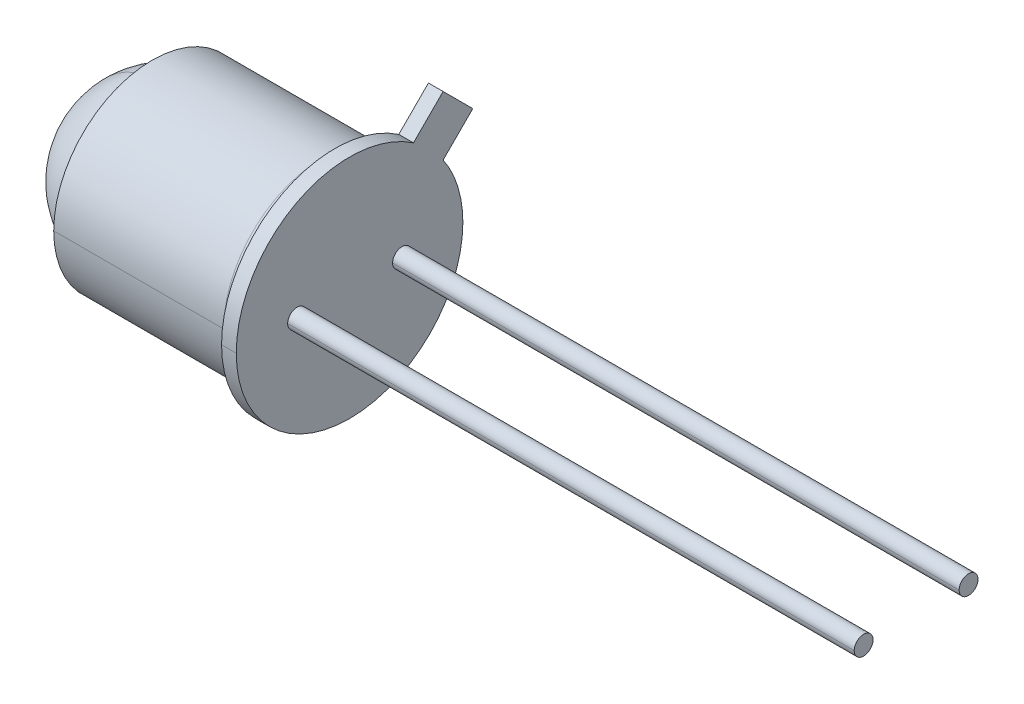
ISO-10303-21;
HEADER;
FILE_DESCRIPTION(('STEP AP214'),'2;1');
FILE_NAME('part.step','',(''),(''),'','','');
FILE_SCHEMA(('AUTOMOTIVE_DESIGN { 1 0 10303 214 1 1 1 1 }'));
ENDSEC;
DATA;
#1=APPLICATION_CONTEXT('core data for automotive mechanical design processes');
#2=APPLICATION_PROTOCOL_DEFINITION('international standard','automotive_design',2000,#1);
#3=PRODUCT_CONTEXT('',#1,'mechanical');
#4=PRODUCT('Part','Part','',(#3));
#5=PRODUCT_RELATED_PRODUCT_CATEGORY('part','',(#4));
#6=PRODUCT_DEFINITION_FORMATION('','',#4);
#7=PRODUCT_DEFINITION_CONTEXT('part definition',#1,'design');
#8=PRODUCT_DEFINITION('design','',#6,#7);
#9=PRODUCT_DEFINITION_SHAPE('','',#8);
#10=(LENGTH_UNIT() NAMED_UNIT(*) SI_UNIT(.MILLI.,.METRE.));
#11=(NAMED_UNIT(*) PLANE_ANGLE_UNIT() SI_UNIT($,.RADIAN.));
#12=(NAMED_UNIT(*) SI_UNIT($,.STERADIAN.) SOLID_ANGLE_UNIT());
#13=UNCERTAINTY_MEASURE_WITH_UNIT(LENGTH_MEASURE(1.E-05),#10,'distance_accuracy_value','');
#14=(GEOMETRIC_REPRESENTATION_CONTEXT(3) GLOBAL_UNCERTAINTY_ASSIGNED_CONTEXT((#13)) GLOBAL_UNIT_ASSIGNED_CONTEXT((#10,
#11,#12)) REPRESENTATION_CONTEXT('',''));
#15=CARTESIAN_POINT('',(0.,0.,0.));
#16=DIRECTION('',(0.,0.,1.));
#17=DIRECTION('',(1.,0.,0.));
#18=AXIS2_PLACEMENT_3D('',#15,#16,#17);
#19=CARTESIAN_POINT('',(-2.37352941176471,0.,0.));
#20=DIRECTION('',(0.,0.,-1.));
#21=DIRECTION('',(0.,-1.,0.));
#22=AXIS2_PLACEMENT_3D('',#19,#20,#21);
#23=SPHERICAL_SURFACE('',#22,2.02647058823529);
#24=CARTESIAN_POINT('',(-2.37352941176471,0.,0.));
#25=DIRECTION('',(0.,0.,-1.));
#26=DIRECTION('',(0.,1.,0.));
#27=AXIS2_PLACEMENT_3D('',#24,#25,#26);
#28=CIRCLE('',#27,2.02647058823529);
#29=CARTESIAN_POINT('',(-4.4,0.,0.));
#30=VERTEX_POINT('',#29);
#31=CARTESIAN_POINT('',(-0.347058823529413,0.,0.));
#32=VERTEX_POINT('',#31);
#33=EDGE_CURVE('P0_E11',#30,#32,#28,.T.);
#34=ORIENTED_EDGE('',*,*,#33,.F.);
#35=CARTESIAN_POINT('',(-2.37352941176471,0.,0.));
#36=DIRECTION('',(0.,0.,1.));
#37=DIRECTION('',(1.,0.,0.));
#38=AXIS2_PLACEMENT_3D('',#35,#36,#37);
#39=CIRCLE('',#38,2.02647058823529);
#40=EDGE_CURVE('P0_E24',#30,#32,#39,.T.);
#41=ORIENTED_EDGE('',*,*,#40,.T.);
#42=EDGE_LOOP('',(#34,#41));
#43=FACE_BOUND('',#42,.T.);
#44=ADVANCED_FACE('P0_F16',(#43),#23,.T.);
#45=CARTESIAN_POINT('',(-2.37352941176471,0.,0.));
#46=DIRECTION('',(0.,0.,-1.));
#47=DIRECTION('',(0.,-1.,0.));
#48=AXIS2_PLACEMENT_3D('',#45,#46,#47);
#49=SPHERICAL_SURFACE('',#48,2.02647058823529);
#50=ORIENTED_EDGE('',*,*,#40,.F.);
#51=ORIENTED_EDGE('',*,*,#33,.T.);
#52=EDGE_LOOP('',(#50,#51));
#53=FACE_BOUND('',#52,.T.);
#54=ADVANCED_FACE('P0_F40',(#53),#49,.T.);
#55=CLOSED_SHELL('',(#44,#54));
#56=MANIFOLD_SOLID_BREP('P0_B1',#55);
#57=CARTESIAN_POINT('',(-0.349999999999991,2.58327308511593,-2.58327308511592));
#58=DIRECTION('',(0.,0.707106781186549,-0.707106781186546));
#59=DIRECTION('',(-1.,0.,0.));
#60=AXIS2_PLACEMENT_3D('',#57,#58,#59);
#61=PLANE('',#60);
#62=DIRECTION('',(0.,-0.707106781186546,-0.707106781186549));
#63=VECTOR('',#62,1.);
#64=CARTESIAN_POINT('',(1.65,2.58327308511593,-2.58327308511592));
#65=LINE('',#64,#63);
#66=CARTESIAN_POINT('',(1.65,2.93682647570919,-2.22971969452264));
#67=VERTEX_POINT('',#66);
#68=CARTESIAN_POINT('',(1.65,2.22971969452265,-2.93682647570918));
#69=VERTEX_POINT('',#68);
#70=EDGE_CURVE('P1_E162',#67,#69,#65,.T.);
#71=ORIENTED_EDGE('',*,*,#70,.F.);
#72=DIRECTION('',(1.,0.,0.));
#73=VECTOR('',#72,1.);
#74=CARTESIAN_POINT('',(-0.349999999999991,2.93682647570919,-2.22971969452264));
#75=LINE('',#74,#73);
#76=CARTESIAN_POINT('',(2.,2.93682647570919,-2.22971969452264));
#77=VERTEX_POINT('',#76);
#78=EDGE_CURVE('P1_E11',#67,#77,#75,.T.);
#79=ORIENTED_EDGE('',*,*,#78,.T.);
#80=DIRECTION('',(0.,0.707106781186546,0.707106781186549));
#81=VECTOR('',#80,1.);
#82=CARTESIAN_POINT('',(2.,2.58327308511593,-2.58327308511592));
#83=LINE('',#82,#81);
#84=CARTESIAN_POINT('',(2.,2.22971969452265,-2.93682647570918));
#85=VERTEX_POINT('',#84);
#86=EDGE_CURVE('P1_E159',#85,#77,#83,.T.);
#87=ORIENTED_EDGE('',*,*,#86,.F.);
#88=DIRECTION('',(1.,0.,0.));
#89=VECTOR('',#88,1.);
#90=CARTESIAN_POINT('',(-0.349999999999991,2.22971969452265,-2.93682647570918));
#91=LINE('',#90,#89);
#92=EDGE_CURVE('P1_E27',#69,#85,#91,.T.);
#93=ORIENTED_EDGE('',*,*,#92,.F.);
#94=EDGE_LOOP('',(#71,#79,#87,#93));
#95=FACE_BOUND('',#94,.T.);
#96=ADVANCED_FACE('P1_F16',(#95),#61,.T.);
#97=CARTESIAN_POINT('',(-0.349999999999991,0.35355339059327,0.353553390593271));
#98=DIRECTION('',(0.,0.707106781186546,0.707106781186549));
#99=DIRECTION('',(1.,0.,0.));
#100=AXIS2_PLACEMENT_3D('',#97,#98,#99);
#101=PLANE('',#100);
#102=DIRECTION('',(0.,0.707106781186549,-0.707106781186546));
#103=VECTOR('',#102,1.);
#104=CARTESIAN_POINT('',(1.65,0.35355339059327,0.353553390593271));
#105=LINE('',#104,#103);
#106=CARTESIAN_POINT('',(1.65,2.22971969452264,-1.5226129133361));
#107=VERTEX_POINT('',#106);
#108=EDGE_CURVE('P1_E218',#107,#67,#105,.T.);
#109=ORIENTED_EDGE('',*,*,#108,.F.);
#110=DIRECTION('',(1.,0.,0.));
#111=VECTOR('',#110,1.);
#112=CARTESIAN_POINT('',(-0.349999999999991,2.22971969452264,-1.5226129133361));
#113=LINE('',#112,#111);
#114=CARTESIAN_POINT('',(2.,2.22971969452264,-1.5226129133361));
#115=VERTEX_POINT('',#114);
#116=EDGE_CURVE('P1_E170',#107,#115,#113,.T.);
#117=ORIENTED_EDGE('',*,*,#116,.T.);
#118=DIRECTION('',(0.,-0.707106781186549,0.707106781186546));
#119=VECTOR('',#118,1.);
#120=CARTESIAN_POINT('',(2.,0.35355339059327,0.353553390593271));
#121=LINE('',#120,#119);
#122=EDGE_CURVE('P1_E167',#77,#115,#121,.T.);
#123=ORIENTED_EDGE('',*,*,#122,.F.);
#124=ORIENTED_EDGE('',*,*,#78,.F.);
#125=EDGE_LOOP('',(#109,#117,#123,#124));
#126=FACE_BOUND('',#125,.T.);
#127=ADVANCED_FACE('P1_F168',(#126),#101,.T.);
#128=CARTESIAN_POINT('',(-0.349999999999991,-0.35355339059327,-0.353553390593272));
#129=DIRECTION('',(0.,0.707106781186546,0.707106781186549));
#130=DIRECTION('',(1.,0.,0.));
#131=AXIS2_PLACEMENT_3D('',#128,#129,#130);
#132=PLANE('',#131);
#133=DIRECTION('',(1.,0.,0.));
#134=VECTOR('',#133,1.);
#135=CARTESIAN_POINT('',(-0.349999999999991,1.52261291333611,-2.22971969452264));
#136=LINE('',#135,#134);
#137=CARTESIAN_POINT('',(1.65,1.52261291333611,-2.22971969452264));
#138=VERTEX_POINT('',#137);
#139=CARTESIAN_POINT('',(2.,1.52261291333611,-2.22971969452264));
#140=VERTEX_POINT('',#139);
#141=EDGE_CURVE('P1_E196',#138,#140,#136,.T.);
#142=ORIENTED_EDGE('',*,*,#141,.F.);
#143=DIRECTION('',(0.,0.707106781186549,-0.707106781186546));
#144=VECTOR('',#143,1.);
#145=CARTESIAN_POINT('',(1.65,-0.35355339059327,-0.353553390593272));
#146=LINE('',#145,#144);
#147=EDGE_CURVE('P1_E211',#138,#69,#146,.T.);
#148=ORIENTED_EDGE('',*,*,#147,.T.);
#149=ORIENTED_EDGE('',*,*,#92,.T.);
#150=DIRECTION('',(0.,-0.707106781186549,0.707106781186546));
#151=VECTOR('',#150,1.);
#152=CARTESIAN_POINT('',(2.,-0.35355339059327,-0.353553390593272));
#153=LINE('',#152,#151);
#154=EDGE_CURVE('P1_E179',#85,#140,#153,.T.);
#155=ORIENTED_EDGE('',*,*,#154,.T.);
#156=EDGE_LOOP('',(#142,#148,#149,#155));
#157=FACE_BOUND('',#156,.T.);
#158=ADVANCED_FACE('P1_F424',(#157),#132,.F.);
#159=CARTESIAN_POINT('',(15.5,0.,0.));
#160=DIRECTION('',(1.,0.,0.));
#161=DIRECTION('',(0.,1.,0.));
#162=AXIS2_PLACEMENT_3D('',#159,#160,#161);
#163=PLANE('',#162);
#164=CARTESIAN_POINT('',(15.5,0.,-1.25));
#165=DIRECTION('',(1.,0.,0.));
#166=DIRECTION('',(0.,0.,-1.));
#167=AXIS2_PLACEMENT_3D('',#164,#165,#166);
#168=CIRCLE('',#167,0.225);
#169=CARTESIAN_POINT('',(15.5,0.,-1.025));
#170=VERTEX_POINT('',#169);
#171=CARTESIAN_POINT('',(15.5,0.,-1.475));
#172=VERTEX_POINT('',#171);
#173=EDGE_CURVE('P1_E214',#170,#172,#168,.T.);
#174=ORIENTED_EDGE('',*,*,#173,.T.);
#175=CARTESIAN_POINT('',(15.5,0.,-1.25));
#176=DIRECTION('',(1.,0.,0.));
#177=DIRECTION('',(0.,0.,-1.));
#178=AXIS2_PLACEMENT_3D('',#175,#176,#177);
#179=CIRCLE('',#178,0.225);
#180=EDGE_CURVE('P1_E278',#172,#170,#179,.T.);
#181=ORIENTED_EDGE('',*,*,#180,.T.);
#182=EDGE_LOOP('',(#174,#181));
#183=FACE_BOUND('',#182,.T.);
#184=ADVANCED_FACE('P1_F417',(#183),#163,.T.);
#185=CARTESIAN_POINT('',(15.5,0.,-1.25));
#186=DIRECTION('',(-1.,0.,0.));
#187=DIRECTION('',(0.,0.,1.));
#188=AXIS2_PLACEMENT_3D('',#185,#186,#187);
#189=CYLINDRICAL_SURFACE('',#188,0.225);
#190=DIRECTION('',(-1.,0.,0.));
#191=VECTOR('',#190,1.);
#192=CARTESIAN_POINT('',(15.5,0.,-1.475));
#193=LINE('',#192,#191);
#194=CARTESIAN_POINT('',(2.,0.,-1.475));
#195=VERTEX_POINT('',#194);
#196=EDGE_CURVE('P1_E236',#172,#195,#193,.T.);
#197=ORIENTED_EDGE('',*,*,#196,.F.);
#198=ORIENTED_EDGE('',*,*,#173,.F.);
#199=DIRECTION('',(-1.,0.,0.));
#200=VECTOR('',#199,1.);
#201=CARTESIAN_POINT('',(15.5,0.,-1.025));
#202=LINE('',#201,#200);
#203=CARTESIAN_POINT('',(2.,0.,-1.025));
#204=VERTEX_POINT('',#203);
#205=EDGE_CURVE('P1_E235',#170,#204,#202,.T.);
#206=ORIENTED_EDGE('',*,*,#205,.T.);
#207=CARTESIAN_POINT('',(2.,0.,-1.25));
#208=DIRECTION('',(1.,0.,0.));
#209=DIRECTION('',(0.,0.,1.));
#210=AXIS2_PLACEMENT_3D('',#207,#208,#209);
#211=CIRCLE('',#210,0.225);
#212=EDGE_CURVE('P1_E117',#204,#195,#211,.T.);
#213=ORIENTED_EDGE('',*,*,#212,.T.);
#214=EDGE_LOOP('',(#197,#198,#206,#213));
#215=FACE_BOUND('',#214,.T.);
#216=ADVANCED_FACE('P1_F423',(#215),#189,.T.);
#217=CARTESIAN_POINT('',(15.5,0.,0.));
#218=DIRECTION('',(1.,0.,0.));
#219=DIRECTION('',(0.,1.,0.));
#220=AXIS2_PLACEMENT_3D('',#217,#218,#219);
#221=PLANE('',#220);
#222=CARTESIAN_POINT('',(15.5,0.,1.25));
#223=DIRECTION('',(1.,0.,0.));
#224=DIRECTION('',(0.,0.,-1.));
#225=AXIS2_PLACEMENT_3D('',#222,#223,#224);
#226=CIRCLE('',#225,0.225);
#227=CARTESIAN_POINT('',(15.5,0.,1.475));
#228=VERTEX_POINT('',#227);
#229=CARTESIAN_POINT('',(15.5,0.,1.025));
#230=VERTEX_POINT('',#229);
#231=EDGE_CURVE('P1_E106',#228,#230,#226,.T.);
#232=ORIENTED_EDGE('',*,*,#231,.T.);
#233=CARTESIAN_POINT('',(15.5,0.,1.25));
#234=DIRECTION('',(1.,0.,0.));
#235=DIRECTION('',(0.,0.,-1.));
#236=AXIS2_PLACEMENT_3D('',#233,#234,#235);
#237=CIRCLE('',#236,0.225);
#238=EDGE_CURVE('P1_E296',#230,#228,#237,.T.);
#239=ORIENTED_EDGE('',*,*,#238,.T.);
#240=EDGE_LOOP('',(#232,#239));
#241=FACE_BOUND('',#240,.T.);
#242=ADVANCED_FACE('P1_F437',(#241),#221,.T.);
#243=CARTESIAN_POINT('',(15.5,0.,1.25));
#244=DIRECTION('',(-1.,0.,0.));
#245=DIRECTION('',(0.,0.,1.));
#246=AXIS2_PLACEMENT_3D('',#243,#244,#245);
#247=CYLINDRICAL_SURFACE('',#246,0.225);
#248=DIRECTION('',(-1.,0.,0.));
#249=VECTOR('',#248,1.);
#250=CARTESIAN_POINT('',(15.5,0.,1.025));
#251=LINE('',#250,#249);
#252=CARTESIAN_POINT('',(2.,0.,1.025));
#253=VERTEX_POINT('',#252);
#254=EDGE_CURVE('P1_E299',#230,#253,#251,.T.);
#255=ORIENTED_EDGE('',*,*,#254,.F.);
#256=ORIENTED_EDGE('',*,*,#231,.F.);
#257=DIRECTION('',(-1.,0.,0.));
#258=VECTOR('',#257,1.);
#259=CARTESIAN_POINT('',(15.5,0.,1.475));
#260=LINE('',#259,#258);
#261=CARTESIAN_POINT('',(2.,0.,1.475));
#262=VERTEX_POINT('',#261);
#263=EDGE_CURVE('P1_E312',#228,#262,#260,.T.);
#264=ORIENTED_EDGE('',*,*,#263,.T.);
#265=CARTESIAN_POINT('',(2.,0.,1.25));
#266=DIRECTION('',(1.,0.,0.));
#267=DIRECTION('',(0.,0.,1.));
#268=AXIS2_PLACEMENT_3D('',#265,#266,#267);
#269=CIRCLE('',#268,0.225);
#270=EDGE_CURVE('P1_E174',#262,#253,#269,.T.);
#271=ORIENTED_EDGE('',*,*,#270,.T.);
#272=EDGE_LOOP('',(#255,#256,#264,#271));
#273=FACE_BOUND('',#272,.T.);
#274=ADVANCED_FACE('P1_F442',(#273),#247,.T.);
#275=CARTESIAN_POINT('',(-2.49171245983604,0.,0.));
#276=DIRECTION('',(-1.,0.,0.));
#277=DIRECTION('',(0.,0.,1.));
#278=AXIS2_PLACEMENT_3D('',#275,#276,#277);
#279=CYLINDRICAL_SURFACE('',#278,2.35);
#280=DIRECTION('',(-1.,0.,0.));
#281=VECTOR('',#280,1.);
#282=CARTESIAN_POINT('',(-2.49171245983604,0.,-2.35));
#283=LINE('',#282,#281);
#284=CARTESIAN_POINT('',(1.35,0.,-2.35));
#285=VERTEX_POINT('',#284);
#286=CARTESIAN_POINT('',(-2.7,0.,-2.35));
#287=VERTEX_POINT('',#286);
#288=EDGE_CURVE('P1_E332',#285,#287,#283,.T.);
#289=ORIENTED_EDGE('',*,*,#288,.F.);
#290=CARTESIAN_POINT('',(1.35,0.,0.));
#291=DIRECTION('',(-1.,0.,0.));
#292=DIRECTION('',(0.,0.,1.));
#293=AXIS2_PLACEMENT_3D('',#290,#291,#292);
#294=CIRCLE('',#293,2.35);
#295=CARTESIAN_POINT('',(1.35,0.,2.35));
#296=VERTEX_POINT('',#295);
#297=EDGE_CURVE('P1_E205',#285,#296,#294,.T.);
#298=ORIENTED_EDGE('',*,*,#297,.T.);
#299=DIRECTION('',(-1.,0.,0.));
#300=VECTOR('',#299,1.);
#301=CARTESIAN_POINT('',(-2.49171245983604,0.,2.35));
#302=LINE('',#301,#300);
#303=CARTESIAN_POINT('',(-2.7,0.,2.35));
#304=VERTEX_POINT('',#303);
#305=EDGE_CURVE('P1_E201',#296,#304,#302,.T.);
#306=ORIENTED_EDGE('',*,*,#305,.T.);
#307=CARTESIAN_POINT('',(-2.7,0.,0.));
#308=DIRECTION('',(-1.,0.,0.));
#309=DIRECTION('',(0.,0.,1.));
#310=AXIS2_PLACEMENT_3D('',#307,#308,#309);
#311=CIRCLE('',#310,2.35);
#312=EDGE_CURVE('P1_E283',#287,#304,#311,.T.);
#313=ORIENTED_EDGE('',*,*,#312,.F.);
#314=EDGE_LOOP('',(#289,#298,#306,#313));
#315=FACE_BOUND('',#314,.T.);
#316=ADVANCED_FACE('P1_F367',(#315),#279,.T.);
#317=CARTESIAN_POINT('',(1.35,0.,0.));
#318=DIRECTION('',(-1.,0.,0.));
#319=DIRECTION('',(0.,0.,1.));
#320=AXIS2_PLACEMENT_3D('',#317,#318,#319);
#321=TOROIDAL_SURFACE('',#320,2.65,0.3);
#322=CARTESIAN_POINT('',(1.35,0.,-2.65));
#323=DIRECTION('',(0.,1.,0.));
#324=DIRECTION('',(0.,0.,1.));
#325=AXIS2_PLACEMENT_3D('',#322,#323,#324);
#326=CIRCLE('',#325,0.3);
#327=CARTESIAN_POINT('',(1.65,0.,-2.65));
#328=VERTEX_POINT('',#327);
#329=EDGE_CURVE('P1_E265',#285,#328,#326,.T.);
#330=ORIENTED_EDGE('',*,*,#329,.F.);
#331=CARTESIAN_POINT('',(1.35,0.,0.));
#332=DIRECTION('',(-1.,0.,0.));
#333=DIRECTION('',(0.,0.,1.));
#334=AXIS2_PLACEMENT_3D('',#331,#332,#333);
#335=CIRCLE('',#334,2.35);
#336=EDGE_CURVE('P1_E320',#296,#285,#335,.T.);
#337=ORIENTED_EDGE('',*,*,#336,.F.);
#338=CARTESIAN_POINT('',(1.35,0.,2.65));
#339=DIRECTION('',(0.,-1.,0.));
#340=DIRECTION('',(0.,0.,-1.));
#341=AXIS2_PLACEMENT_3D('',#338,#339,#340);
#342=CIRCLE('',#341,0.3);
#343=CARTESIAN_POINT('',(1.65,0.,2.65));
#344=VERTEX_POINT('',#343);
#345=EDGE_CURVE('P1_E264',#296,#344,#342,.T.);
#346=ORIENTED_EDGE('',*,*,#345,.T.);
#347=CARTESIAN_POINT('',(1.65,0.,0.));
#348=DIRECTION('',(-1.,0.,0.));
#349=DIRECTION('',(0.,0.,1.));
#350=AXIS2_PLACEMENT_3D('',#347,#348,#349);
#351=CIRCLE('',#350,2.65);
#352=EDGE_CURVE('P1_E207',#344,#328,#351,.T.);
#353=ORIENTED_EDGE('',*,*,#352,.T.);
#354=EDGE_LOOP('',(#330,#337,#346,#353));
#355=FACE_BOUND('',#354,.T.);
#356=ADVANCED_FACE('P1_F18',(#355),#321,.F.);
#357=CARTESIAN_POINT('',(1.65,2.7,0.));
#358=DIRECTION('',(1.,0.,0.));
#359=DIRECTION('',(0.,1.,0.));
#360=AXIS2_PLACEMENT_3D('',#357,#358,#359);
#361=PLANE('',#360);
#362=ORIENTED_EDGE('',*,*,#352,.F.);
#363=CARTESIAN_POINT('',(1.65,0.,0.));
#364=DIRECTION('',(-1.,0.,0.));
#365=DIRECTION('',(0.,0.,1.));
#366=AXIS2_PLACEMENT_3D('',#363,#364,#365);
#367=CIRCLE('',#366,2.65);
#368=EDGE_CURVE('P1_E260',#328,#344,#367,.T.);
#369=ORIENTED_EDGE('',*,*,#368,.F.);
#370=EDGE_LOOP('',(#362,#369));
#371=FACE_BOUND('',#370,.T.);
#372=CARTESIAN_POINT('',(1.65,0.,0.));
#373=DIRECTION('',(-1.,0.,0.));
#374=DIRECTION('',(0.,0.,1.));
#375=AXIS2_PLACEMENT_3D('',#372,#373,#374);
#376=CIRCLE('',#375,2.7);
#377=CARTESIAN_POINT('',(1.65,0.,-2.7));
#378=VERTEX_POINT('',#377);
#379=EDGE_CURVE('P1_E192',#138,#378,#376,.T.);
#380=ORIENTED_EDGE('',*,*,#379,.T.);
#381=CARTESIAN_POINT('',(1.65,0.,0.));
#382=DIRECTION('',(-1.,0.,0.));
#383=DIRECTION('',(0.,0.,1.));
#384=AXIS2_PLACEMENT_3D('',#381,#382,#383);
#385=CIRCLE('',#384,2.7);
#386=CARTESIAN_POINT('',(1.65,0.,2.7));
#387=VERTEX_POINT('',#386);
#388=EDGE_CURVE('P1_E20',#378,#387,#385,.T.);
#389=ORIENTED_EDGE('',*,*,#388,.T.);
#390=CARTESIAN_POINT('',(1.65,0.,0.));
#391=DIRECTION('',(-1.,0.,0.));
#392=DIRECTION('',(0.,0.,1.));
#393=AXIS2_PLACEMENT_3D('',#390,#391,#392);
#394=CIRCLE('',#393,2.7);
#395=EDGE_CURVE('P1_E186',#387,#107,#394,.T.);
#396=ORIENTED_EDGE('',*,*,#395,.T.);
#397=ORIENTED_EDGE('',*,*,#108,.T.);
#398=ORIENTED_EDGE('',*,*,#70,.T.);
#399=ORIENTED_EDGE('',*,*,#147,.F.);
#400=EDGE_LOOP('',(#380,#389,#396,#397,#398,#399));
#401=FACE_BOUND('',#400,.T.);
#402=ADVANCED_FACE('P1_F376',(#371,#401),#361,.F.);
#403=CARTESIAN_POINT('',(0.,0.,0.));
#404=DIRECTION('',(1.,0.,0.));
#405=DIRECTION('',(0.,1.,0.));
#406=AXIS2_PLACEMENT_3D('',#403,#404,#405);
#407=PLANE('',#406);
#408=CARTESIAN_POINT('',(0.,0.,0.));
#409=DIRECTION('',(-1.,0.,0.));
#410=DIRECTION('',(0.,0.,1.));
#411=AXIS2_PLACEMENT_3D('',#408,#409,#410);
#412=CIRCLE('',#411,1.9);
#413=CARTESIAN_POINT('',(0.,0.,1.9));
#414=VERTEX_POINT('',#413);
#415=CARTESIAN_POINT('',(0.,0.,-1.9));
#416=VERTEX_POINT('',#415);
#417=EDGE_CURVE('P1_E221',#414,#416,#412,.T.);
#418=ORIENTED_EDGE('',*,*,#417,.T.);
#419=CARTESIAN_POINT('',(0.,0.,0.));
#420=DIRECTION('',(-1.,0.,0.));
#421=DIRECTION('',(0.,0.,1.));
#422=AXIS2_PLACEMENT_3D('',#419,#420,#421);
#423=CIRCLE('',#422,1.9);
#424=EDGE_CURVE('P1_E266',#416,#414,#423,.T.);
#425=ORIENTED_EDGE('',*,*,#424,.T.);
#426=EDGE_LOOP('',(#418,#425));
#427=FACE_BOUND('',#426,.T.);
#428=ADVANCED_FACE('P1_F477',(#427),#407,.F.);
#429=CARTESIAN_POINT('',(-2.49171245983604,0.,0.));
#430=DIRECTION('',(-1.,0.,0.));
#431=DIRECTION('',(0.,0.,1.));
#432=AXIS2_PLACEMENT_3D('',#429,#430,#431);
#433=CYLINDRICAL_SURFACE('',#432,1.9);
#434=DIRECTION('',(-1.,0.,0.));
#435=VECTOR('',#434,1.);
#436=CARTESIAN_POINT('',(-2.49171245983604,0.,-1.9));
#437=LINE('',#436,#435);
#438=CARTESIAN_POINT('',(-2.4,0.,-1.9));
#439=VERTEX_POINT('',#438);
#440=EDGE_CURVE('P1_E270',#416,#439,#437,.T.);
#441=ORIENTED_EDGE('',*,*,#440,.F.);
#442=ORIENTED_EDGE('',*,*,#417,.F.);
#443=DIRECTION('',(-1.,0.,0.));
#444=VECTOR('',#443,1.);
#445=CARTESIAN_POINT('',(-2.49171245983604,0.,1.9));
#446=LINE('',#445,#444);
#447=CARTESIAN_POINT('',(-2.4,0.,1.9));
#448=VERTEX_POINT('',#447);
#449=EDGE_CURVE('P1_E242',#414,#448,#446,.T.);
#450=ORIENTED_EDGE('',*,*,#449,.T.);
#451=CARTESIAN_POINT('',(-2.4,0.,0.));
#452=DIRECTION('',(-1.,0.,0.));
#453=DIRECTION('',(0.,0.,1.));
#454=AXIS2_PLACEMENT_3D('',#451,#452,#453);
#455=CIRCLE('',#454,1.9);
#456=EDGE_CURVE('P1_E222',#448,#439,#455,.T.);
#457=ORIENTED_EDGE('',*,*,#456,.T.);
#458=EDGE_LOOP('',(#441,#442,#450,#457));
#459=FACE_BOUND('',#458,.T.);
#460=ADVANCED_FACE('P1_F485',(#459),#433,.F.);
#461=CARTESIAN_POINT('',(-2.4,2.,0.));
#462=DIRECTION('',(1.,0.,0.));
#463=DIRECTION('',(0.,1.,0.));
#464=AXIS2_PLACEMENT_3D('',#461,#462,#463);
#465=PLANE('',#464);
#466=ORIENTED_EDGE('',*,*,#456,.F.);
#467=CARTESIAN_POINT('',(-2.4,0.,0.));
#468=DIRECTION('',(-1.,0.,0.));
#469=DIRECTION('',(0.,0.,1.));
#470=AXIS2_PLACEMENT_3D('',#467,#468,#469);
#471=CIRCLE('',#470,1.9);
#472=EDGE_CURVE('P1_E252',#439,#448,#471,.T.);
#473=ORIENTED_EDGE('',*,*,#472,.F.);
#474=EDGE_LOOP('',(#466,#473));
#475=FACE_BOUND('',#474,.T.);
#476=CARTESIAN_POINT('',(-2.4,0.,0.));
#477=DIRECTION('',(-1.,0.,0.));
#478=DIRECTION('',(0.,0.,1.));
#479=AXIS2_PLACEMENT_3D('',#476,#477,#478);
#480=CIRCLE('',#479,2.);
#481=CARTESIAN_POINT('',(-2.4,0.,2.));
#482=VERTEX_POINT('',#481);
#483=CARTESIAN_POINT('',(-2.4,0.,-2.));
#484=VERTEX_POINT('',#483);
#485=EDGE_CURVE('P1_E225',#482,#484,#480,.T.);
#486=ORIENTED_EDGE('',*,*,#485,.T.);
#487=CARTESIAN_POINT('',(-2.4,0.,0.));
#488=DIRECTION('',(-1.,0.,0.));
#489=DIRECTION('',(0.,0.,1.));
#490=AXIS2_PLACEMENT_3D('',#487,#488,#489);
#491=CIRCLE('',#490,2.);
#492=EDGE_CURVE('P1_E237',#484,#482,#491,.T.);
#493=ORIENTED_EDGE('',*,*,#492,.T.);
#494=EDGE_LOOP('',(#486,#493));
#495=FACE_BOUND('',#494,.T.);
#496=ADVANCED_FACE('P1_F494',(#475,#495),#465,.F.);
#497=CARTESIAN_POINT('',(-2.49171245983604,0.,0.));
#498=DIRECTION('',(-1.,0.,0.));
#499=DIRECTION('',(0.,0.,1.));
#500=AXIS2_PLACEMENT_3D('',#497,#498,#499);
#501=CYLINDRICAL_SURFACE('',#500,2.);
#502=DIRECTION('',(-1.,0.,0.));
#503=VECTOR('',#502,1.);
#504=CARTESIAN_POINT('',(-2.49171245983604,0.,-2.));
#505=LINE('',#504,#503);
#506=CARTESIAN_POINT('',(-2.7,0.,-2.));
#507=VERTEX_POINT('',#506);
#508=EDGE_CURVE('P1_E241',#484,#507,#505,.T.);
#509=ORIENTED_EDGE('',*,*,#508,.F.);
#510=ORIENTED_EDGE('',*,*,#485,.F.);
#511=DIRECTION('',(-1.,0.,0.));
#512=VECTOR('',#511,1.);
#513=CARTESIAN_POINT('',(-2.49171245983604,0.,2.));
#514=LINE('',#513,#512);
#515=CARTESIAN_POINT('',(-2.7,0.,2.));
#516=VERTEX_POINT('',#515);
#517=EDGE_CURVE('P1_E230',#482,#516,#514,.T.);
#518=ORIENTED_EDGE('',*,*,#517,.T.);
#519=CARTESIAN_POINT('',(-2.7,0.,0.));
#520=DIRECTION('',(-1.,0.,0.));
#521=DIRECTION('',(0.,0.,1.));
#522=AXIS2_PLACEMENT_3D('',#519,#520,#521);
#523=CIRCLE('',#522,2.);
#524=EDGE_CURVE('P1_E302',#516,#507,#523,.T.);
#525=ORIENTED_EDGE('',*,*,#524,.T.);
#526=EDGE_LOOP('',(#509,#510,#518,#525));
#527=FACE_BOUND('',#526,.T.);
#528=ADVANCED_FACE('P1_F503',(#527),#501,.F.);
#529=CARTESIAN_POINT('',(-2.7,2.,0.));
#530=DIRECTION('',(1.,0.,0.));
#531=DIRECTION('',(0.,1.,0.));
#532=AXIS2_PLACEMENT_3D('',#529,#530,#531);
#533=PLANE('',#532);
#534=ORIENTED_EDGE('',*,*,#524,.F.);
#535=CARTESIAN_POINT('',(-2.7,0.,0.));
#536=DIRECTION('',(-1.,0.,0.));
#537=DIRECTION('',(0.,0.,1.));
#538=AXIS2_PLACEMENT_3D('',#535,#536,#537);
#539=CIRCLE('',#538,2.);
#540=EDGE_CURVE('P1_E271',#507,#516,#539,.T.);
#541=ORIENTED_EDGE('',*,*,#540,.F.);
#542=EDGE_LOOP('',(#534,#541));
#543=FACE_BOUND('',#542,.T.);
#544=CARTESIAN_POINT('',(-2.7,0.,0.));
#545=DIRECTION('',(-1.,0.,0.));
#546=DIRECTION('',(0.,0.,1.));
#547=AXIS2_PLACEMENT_3D('',#544,#545,#546);
#548=CIRCLE('',#547,2.35);
#549=EDGE_CURVE('P1_E206',#304,#287,#548,.T.);
#550=ORIENTED_EDGE('',*,*,#549,.T.);
#551=ORIENTED_EDGE('',*,*,#312,.T.);
#552=EDGE_LOOP('',(#550,#551));
#553=FACE_BOUND('',#552,.T.);
#554=ADVANCED_FACE('P1_F357',(#543,#553),#533,.F.);
#555=CARTESIAN_POINT('',(2.,0.,0.));
#556=DIRECTION('',(-1.,0.,0.));
#557=DIRECTION('',(0.,0.,1.));
#558=AXIS2_PLACEMENT_3D('',#555,#556,#557);
#559=PLANE('',#558);
#560=ORIENTED_EDGE('',*,*,#212,.F.);
#561=CARTESIAN_POINT('',(2.,0.,-1.25));
#562=DIRECTION('',(1.,0.,0.));
#563=DIRECTION('',(0.,0.,1.));
#564=AXIS2_PLACEMENT_3D('',#561,#562,#563);
#565=CIRCLE('',#564,0.225);
#566=EDGE_CURVE('P1_E231',#195,#204,#565,.T.);
#567=ORIENTED_EDGE('',*,*,#566,.F.);
#568=EDGE_LOOP('',(#560,#567));
#569=FACE_BOUND('',#568,.T.);
#570=ORIENTED_EDGE('',*,*,#270,.F.);
#571=CARTESIAN_POINT('',(2.,0.,1.25));
#572=DIRECTION('',(1.,0.,0.));
#573=DIRECTION('',(0.,0.,1.));
#574=AXIS2_PLACEMENT_3D('',#571,#572,#573);
#575=CIRCLE('',#574,0.225);
#576=EDGE_CURVE('P1_E305',#253,#262,#575,.T.);
#577=ORIENTED_EDGE('',*,*,#576,.F.);
#578=EDGE_LOOP('',(#570,#577));
#579=FACE_BOUND('',#578,.T.);
#580=CARTESIAN_POINT('',(2.,0.,0.));
#581=DIRECTION('',(-1.,0.,0.));
#582=DIRECTION('',(0.,0.,1.));
#583=AXIS2_PLACEMENT_3D('',#580,#581,#582);
#584=CIRCLE('',#583,2.7);
#585=CARTESIAN_POINT('',(2.,0.,-2.7));
#586=VERTEX_POINT('',#585);
#587=EDGE_CURVE('P1_E226',#140,#586,#584,.T.);
#588=ORIENTED_EDGE('',*,*,#587,.F.);
#589=ORIENTED_EDGE('',*,*,#154,.F.);
#590=ORIENTED_EDGE('',*,*,#86,.T.);
#591=ORIENTED_EDGE('',*,*,#122,.T.);
#592=CARTESIAN_POINT('',(2.,0.,0.));
#593=DIRECTION('',(-1.,0.,0.));
#594=DIRECTION('',(0.,0.,1.));
#595=AXIS2_PLACEMENT_3D('',#592,#593,#594);
#596=CIRCLE('',#595,2.7);
#597=CARTESIAN_POINT('',(2.,0.,2.7));
#598=VERTEX_POINT('',#597);
#599=EDGE_CURVE('P1_E200',#598,#115,#596,.T.);
#600=ORIENTED_EDGE('',*,*,#599,.F.);
#601=CARTESIAN_POINT('',(2.,0.,0.));
#602=DIRECTION('',(-1.,0.,0.));
#603=DIRECTION('',(0.,0.,1.));
#604=AXIS2_PLACEMENT_3D('',#601,#602,#603);
#605=CIRCLE('',#604,2.7);
#606=EDGE_CURVE('P1_E190',#586,#598,#605,.T.);
#607=ORIENTED_EDGE('',*,*,#606,.F.);
#608=EDGE_LOOP('',(#588,#589,#590,#591,#600,#607));
#609=FACE_BOUND('',#608,.T.);
#610=ADVANCED_FACE('P1_F177',(#569,#579,#609),#559,.F.);
#611=CARTESIAN_POINT('',(-2.49171245983604,0.,0.));
#612=DIRECTION('',(-1.,0.,0.));
#613=DIRECTION('',(0.,0.,1.));
#614=AXIS2_PLACEMENT_3D('',#611,#612,#613);
#615=CYLINDRICAL_SURFACE('',#614,2.7);
#616=DIRECTION('',(-1.,0.,0.));
#617=VECTOR('',#616,1.);
#618=CARTESIAN_POINT('',(-2.49171245983604,0.,2.7));
#619=LINE('',#618,#617);
#620=EDGE_CURVE('P1_E246',#598,#387,#619,.T.);
#621=ORIENTED_EDGE('',*,*,#620,.F.);
#622=ORIENTED_EDGE('',*,*,#599,.T.);
#623=ORIENTED_EDGE('',*,*,#116,.F.);
#624=ORIENTED_EDGE('',*,*,#395,.F.);
#625=EDGE_LOOP('',(#621,#622,#623,#624));
#626=FACE_BOUND('',#625,.T.);
#627=ADVANCED_FACE('P1_F528',(#626),#615,.T.);
#628=CARTESIAN_POINT('',(-2.49171245983604,0.,0.));
#629=DIRECTION('',(-1.,0.,0.));
#630=DIRECTION('',(0.,0.,1.));
#631=AXIS2_PLACEMENT_3D('',#628,#629,#630);
#632=CYLINDRICAL_SURFACE('',#631,2.7);
#633=DIRECTION('',(-1.,0.,0.));
#634=VECTOR('',#633,1.);
#635=CARTESIAN_POINT('',(-2.49171245983604,0.,-2.7));
#636=LINE('',#635,#634);
#637=EDGE_CURVE('P1_E197',#586,#378,#636,.T.);
#638=ORIENTED_EDGE('',*,*,#637,.F.);
#639=ORIENTED_EDGE('',*,*,#606,.T.);
#640=ORIENTED_EDGE('',*,*,#620,.T.);
#641=ORIENTED_EDGE('',*,*,#388,.F.);
#642=EDGE_LOOP('',(#638,#639,#640,#641));
#643=FACE_BOUND('',#642,.T.);
#644=ADVANCED_FACE('P1_F536',(#643),#632,.T.);
#645=CARTESIAN_POINT('',(-2.49171245983604,0.,0.));
#646=DIRECTION('',(-1.,0.,0.));
#647=DIRECTION('',(0.,0.,1.));
#648=AXIS2_PLACEMENT_3D('',#645,#646,#647);
#649=CYLINDRICAL_SURFACE('',#648,2.7);
#650=ORIENTED_EDGE('',*,*,#587,.T.);
#651=ORIENTED_EDGE('',*,*,#637,.T.);
#652=ORIENTED_EDGE('',*,*,#379,.F.);
#653=ORIENTED_EDGE('',*,*,#141,.T.);
#654=EDGE_LOOP('',(#650,#651,#652,#653));
#655=FACE_BOUND('',#654,.T.);
#656=ADVANCED_FACE('P1_F545',(#655),#649,.T.);
#657=CARTESIAN_POINT('',(-2.49171245983604,0.,0.));
#658=DIRECTION('',(-1.,0.,0.));
#659=DIRECTION('',(0.,0.,1.));
#660=AXIS2_PLACEMENT_3D('',#657,#658,#659);
#661=CYLINDRICAL_SURFACE('',#660,2.);
#662=ORIENTED_EDGE('',*,*,#492,.F.);
#663=ORIENTED_EDGE('',*,*,#508,.T.);
#664=ORIENTED_EDGE('',*,*,#540,.T.);
#665=ORIENTED_EDGE('',*,*,#517,.F.);
#666=EDGE_LOOP('',(#662,#663,#664,#665));
#667=FACE_BOUND('',#666,.T.);
#668=ADVANCED_FACE('P1_F554',(#667),#661,.F.);
#669=CARTESIAN_POINT('',(-2.49171245983604,0.,0.));
#670=DIRECTION('',(-1.,0.,0.));
#671=DIRECTION('',(0.,0.,1.));
#672=AXIS2_PLACEMENT_3D('',#669,#670,#671);
#673=CYLINDRICAL_SURFACE('',#672,1.9);
#674=ORIENTED_EDGE('',*,*,#424,.F.);
#675=ORIENTED_EDGE('',*,*,#440,.T.);
#676=ORIENTED_EDGE('',*,*,#472,.T.);
#677=ORIENTED_EDGE('',*,*,#449,.F.);
#678=EDGE_LOOP('',(#674,#675,#676,#677));
#679=FACE_BOUND('',#678,.T.);
#680=ADVANCED_FACE('P1_F563',(#679),#673,.F.);
#681=CARTESIAN_POINT('',(1.35,0.,0.));
#682=DIRECTION('',(-1.,0.,0.));
#683=DIRECTION('',(0.,0.,1.));
#684=AXIS2_PLACEMENT_3D('',#681,#682,#683);
#685=TOROIDAL_SURFACE('',#684,2.65,0.3);
#686=ORIENTED_EDGE('',*,*,#297,.F.);
#687=ORIENTED_EDGE('',*,*,#329,.T.);
#688=ORIENTED_EDGE('',*,*,#368,.T.);
#689=ORIENTED_EDGE('',*,*,#345,.F.);
#690=EDGE_LOOP('',(#686,#687,#688,#689));
#691=FACE_BOUND('',#690,.T.);
#692=ADVANCED_FACE('P1_F374',(#691),#685,.F.);
#693=CARTESIAN_POINT('',(-2.49171245983604,0.,0.));
#694=DIRECTION('',(-1.,0.,0.));
#695=DIRECTION('',(0.,0.,1.));
#696=AXIS2_PLACEMENT_3D('',#693,#694,#695);
#697=CYLINDRICAL_SURFACE('',#696,2.35);
#698=ORIENTED_EDGE('',*,*,#336,.T.);
#699=ORIENTED_EDGE('',*,*,#288,.T.);
#700=ORIENTED_EDGE('',*,*,#549,.F.);
#701=ORIENTED_EDGE('',*,*,#305,.F.);
#702=EDGE_LOOP('',(#698,#699,#700,#701));
#703=FACE_BOUND('',#702,.T.);
#704=ADVANCED_FACE('P1_F364',(#703),#697,.T.);
#705=CARTESIAN_POINT('',(15.5,0.,1.25));
#706=DIRECTION('',(-1.,0.,0.));
#707=DIRECTION('',(0.,0.,1.));
#708=AXIS2_PLACEMENT_3D('',#705,#706,#707);
#709=CYLINDRICAL_SURFACE('',#708,0.225);
#710=ORIENTED_EDGE('',*,*,#238,.F.);
#711=ORIENTED_EDGE('',*,*,#254,.T.);
#712=ORIENTED_EDGE('',*,*,#576,.T.);
#713=ORIENTED_EDGE('',*,*,#263,.F.);
#714=EDGE_LOOP('',(#710,#711,#712,#713));
#715=FACE_BOUND('',#714,.T.);
#716=ADVANCED_FACE('P1_F587',(#715),#709,.T.);
#717=CARTESIAN_POINT('',(15.5,0.,-1.25));
#718=DIRECTION('',(-1.,0.,0.));
#719=DIRECTION('',(0.,0.,1.));
#720=AXIS2_PLACEMENT_3D('',#717,#718,#719);
#721=CYLINDRICAL_SURFACE('',#720,0.225);
#722=ORIENTED_EDGE('',*,*,#180,.F.);
#723=ORIENTED_EDGE('',*,*,#196,.T.);
#724=ORIENTED_EDGE('',*,*,#566,.T.);
#725=ORIENTED_EDGE('',*,*,#205,.F.);
#726=EDGE_LOOP('',(#722,#723,#724,#725));
#727=FACE_BOUND('',#726,.T.);
#728=ADVANCED_FACE('P1_F595',(#727),#721,.T.);
#729=CLOSED_SHELL('',(#96,#127,#158,#184,#216,#242,#274,#316,#356,#402,#428,#460,#496,#528,#554,
#610,#627,#644,#656,#668,#680,#692,#704,#716,#728));
#730=MANIFOLD_SOLID_BREP('P1_B1',#729);
#731=ADVANCED_BREP_SHAPE_REPRESENTATION('',(#18,#56,#730),#14);
#732=SHAPE_DEFINITION_REPRESENTATION(#9,#731);
ENDSEC;
END-ISO-10303-21;
